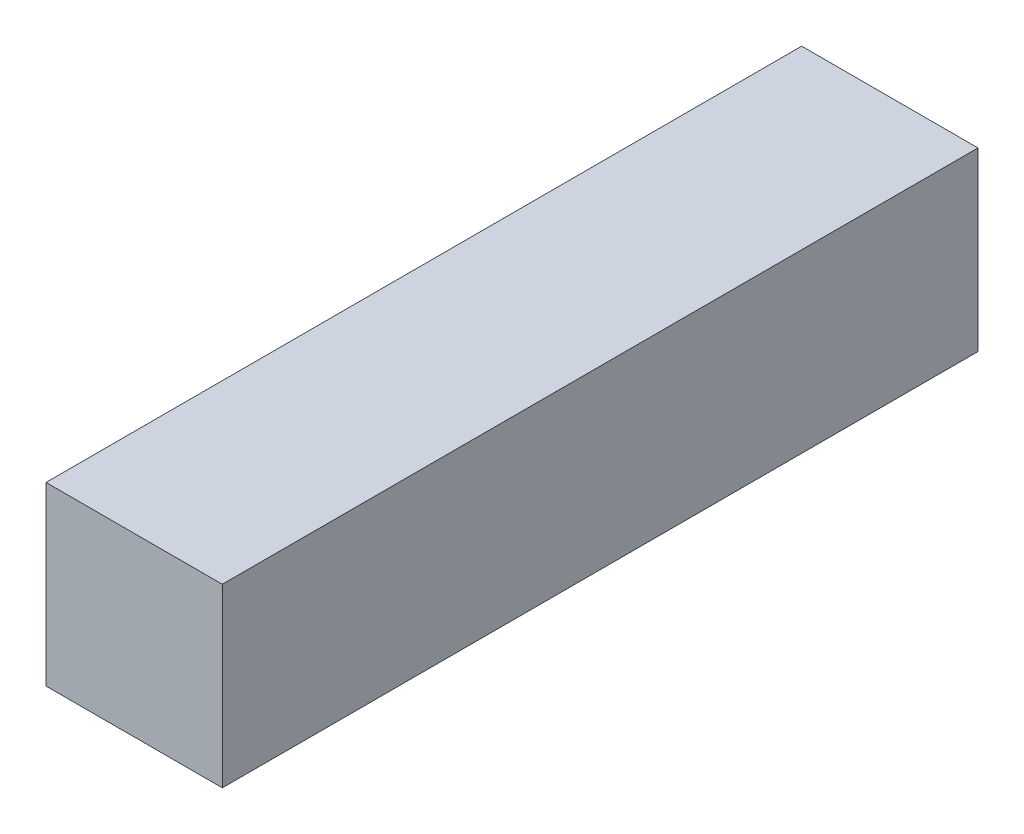
ISO-10303-21;
HEADER;
FILE_DESCRIPTION(('STEP AP214'),'2;1');
FILE_NAME('part.step','',(''),(''),'','','');
FILE_SCHEMA(('AUTOMOTIVE_DESIGN { 1 0 10303 214 1 1 1 1 }'));
ENDSEC;
DATA;
#1=APPLICATION_CONTEXT('core data for automotive mechanical design processes');
#2=APPLICATION_PROTOCOL_DEFINITION('international standard','automotive_design',2000,#1);
#3=PRODUCT_CONTEXT('',#1,'mechanical');
#4=PRODUCT('Part','Part','',(#3));
#5=PRODUCT_RELATED_PRODUCT_CATEGORY('part','',(#4));
#6=PRODUCT_DEFINITION_FORMATION('','',#4);
#7=PRODUCT_DEFINITION_CONTEXT('part definition',#1,'design');
#8=PRODUCT_DEFINITION('design','',#6,#7);
#9=PRODUCT_DEFINITION_SHAPE('','',#8);
#10=(LENGTH_UNIT() NAMED_UNIT(*) SI_UNIT(.MILLI.,.METRE.));
#11=(NAMED_UNIT(*) PLANE_ANGLE_UNIT() SI_UNIT($,.RADIAN.));
#12=(NAMED_UNIT(*) SI_UNIT($,.STERADIAN.) SOLID_ANGLE_UNIT());
#13=UNCERTAINTY_MEASURE_WITH_UNIT(LENGTH_MEASURE(1.E-05),#10,'distance_accuracy_value','');
#14=(GEOMETRIC_REPRESENTATION_CONTEXT(3) GLOBAL_UNCERTAINTY_ASSIGNED_CONTEXT((#13)) GLOBAL_UNIT_ASSIGNED_CONTEXT((#10,
#11,#12)) REPRESENTATION_CONTEXT('',''));
#15=CARTESIAN_POINT('',(0.,0.,0.));
#16=DIRECTION('',(0.,0.,1.));
#17=DIRECTION('',(1.,0.,0.));
#18=AXIS2_PLACEMENT_3D('',#15,#16,#17);
#19=CARTESIAN_POINT('',(-6.99999999998829,7.0000000000016,-30.));
#20=DIRECTION('',(-1.,0.,0.));
#21=DIRECTION('',(0.,0.,1.));
#22=AXIS2_PLACEMENT_3D('',#19,#20,#21);
#23=PLANE('',#22);
#24=DIRECTION('',(0.,-1.,0.));
#25=VECTOR('',#24,1.);
#26=CARTESIAN_POINT('',(-6.99999999998829,7.0000000000016,0.));
#27=LINE('',#26,#25);
#28=CARTESIAN_POINT('',(-6.99999999998829,7.0000000000016,0.));
#29=VERTEX_POINT('',#28);
#30=CARTESIAN_POINT('',(-6.99999999998829,0.,0.));
#31=VERTEX_POINT('',#30);
#32=EDGE_CURVE('E98',#29,#31,#27,.T.);
#33=ORIENTED_EDGE('',*,*,#32,.F.);
#34=DIRECTION('',(0.,0.,1.));
#35=VECTOR('',#34,1.);
#36=CARTESIAN_POINT('',(-6.99999999998829,7.0000000000016,-30.));
#37=LINE('',#36,#35);
#38=CARTESIAN_POINT('',(-6.99999999998829,7.0000000000016,-30.));
#39=VERTEX_POINT('',#38);
#40=EDGE_CURVE('E11',#39,#29,#37,.T.);
#41=ORIENTED_EDGE('',*,*,#40,.F.);
#42=DIRECTION('',(0.,-1.,0.));
#43=VECTOR('',#42,1.);
#44=CARTESIAN_POINT('',(-6.99999999998829,7.0000000000016,-30.));
#45=LINE('',#44,#43);
#46=CARTESIAN_POINT('',(-6.99999999998829,0.,-30.));
#47=VERTEX_POINT('',#46);
#48=EDGE_CURVE('E92',#39,#47,#45,.T.);
#49=ORIENTED_EDGE('',*,*,#48,.T.);
#50=DIRECTION('',(0.,0.,1.));
#51=VECTOR('',#50,1.);
#52=CARTESIAN_POINT('',(-6.99999999998829,0.,-30.));
#53=LINE('',#52,#51);
#54=EDGE_CURVE('E37',#47,#31,#53,.T.);
#55=ORIENTED_EDGE('',*,*,#54,.T.);
#56=EDGE_LOOP('',(#33,#41,#49,#55));
#57=FACE_BOUND('',#56,.T.);
#58=ADVANCED_FACE('F34',(#57),#23,.T.);
#59=CARTESIAN_POINT('',(-6.99999999998829,7.0000000000016,-30.));
#60=DIRECTION('',(0.,1.,0.));
#61=DIRECTION('',(0.,0.,1.));
#62=AXIS2_PLACEMENT_3D('',#59,#60,#61);
#63=PLANE('',#62);
#64=DIRECTION('',(-1.,0.,0.));
#65=VECTOR('',#64,1.);
#66=CARTESIAN_POINT('',(-6.99999999998829,7.0000000000016,0.));
#67=LINE('',#66,#65);
#68=CARTESIAN_POINT('',(0.,7.0000000000016,0.));
#69=VERTEX_POINT('',#68);
#70=EDGE_CURVE('E94',#69,#29,#67,.T.);
#71=ORIENTED_EDGE('',*,*,#70,.F.);
#72=DIRECTION('',(0.,0.,1.));
#73=VECTOR('',#72,1.);
#74=CARTESIAN_POINT('',(0.,7.0000000000016,-30.));
#75=LINE('',#74,#73);
#76=CARTESIAN_POINT('',(0.,7.0000000000016,-30.));
#77=VERTEX_POINT('',#76);
#78=EDGE_CURVE('E43',#77,#69,#75,.T.);
#79=ORIENTED_EDGE('',*,*,#78,.F.);
#80=DIRECTION('',(-1.,0.,0.));
#81=VECTOR('',#80,1.);
#82=CARTESIAN_POINT('',(-6.99999999998829,7.0000000000016,-30.));
#83=LINE('',#82,#81);
#84=EDGE_CURVE('E89',#77,#39,#83,.T.);
#85=ORIENTED_EDGE('',*,*,#84,.T.);
#86=ORIENTED_EDGE('',*,*,#40,.T.);
#87=EDGE_LOOP('',(#71,#79,#85,#86));
#88=FACE_BOUND('',#87,.T.);
#89=ADVANCED_FACE('F108',(#88),#63,.T.);
#90=CARTESIAN_POINT('',(0.,7.0000000000016,-30.));
#91=DIRECTION('',(1.,0.,0.));
#92=DIRECTION('',(0.,0.,-1.));
#93=AXIS2_PLACEMENT_3D('',#90,#91,#92);
#94=PLANE('',#93);
#95=DIRECTION('',(0.,1.,0.));
#96=VECTOR('',#95,1.);
#97=CARTESIAN_POINT('',(0.,7.0000000000016,0.));
#98=LINE('',#97,#96);
#99=CARTESIAN_POINT('',(0.,0.,0.));
#100=VERTEX_POINT('',#99);
#101=EDGE_CURVE('E84',#100,#69,#98,.T.);
#102=ORIENTED_EDGE('',*,*,#101,.F.);
#103=DIRECTION('',(0.,0.,1.));
#104=VECTOR('',#103,1.);
#105=CARTESIAN_POINT('',(0.,0.,-30.));
#106=LINE('',#105,#104);
#107=CARTESIAN_POINT('',(0.,0.,-30.));
#108=VERTEX_POINT('',#107);
#109=EDGE_CURVE('E79',#108,#100,#106,.T.);
#110=ORIENTED_EDGE('',*,*,#109,.F.);
#111=DIRECTION('',(0.,1.,0.));
#112=VECTOR('',#111,1.);
#113=CARTESIAN_POINT('',(0.,7.0000000000016,-30.));
#114=LINE('',#113,#112);
#115=EDGE_CURVE('E82',#108,#77,#114,.T.);
#116=ORIENTED_EDGE('',*,*,#115,.T.);
#117=ORIENTED_EDGE('',*,*,#78,.T.);
#118=EDGE_LOOP('',(#102,#110,#116,#117));
#119=FACE_BOUND('',#118,.T.);
#120=ADVANCED_FACE('F81',(#119),#94,.T.);
#121=CARTESIAN_POINT('',(-6.99999999998829,0.,-30.));
#122=DIRECTION('',(0.,-1.,0.));
#123=DIRECTION('',(0.,0.,-1.));
#124=AXIS2_PLACEMENT_3D('',#121,#122,#123);
#125=PLANE('',#124);
#126=DIRECTION('',(1.,0.,0.));
#127=VECTOR('',#126,1.);
#128=CARTESIAN_POINT('',(-6.99999999998829,0.,0.));
#129=LINE('',#128,#127);
#130=EDGE_CURVE('E101',#31,#100,#129,.T.);
#131=ORIENTED_EDGE('',*,*,#130,.F.);
#132=ORIENTED_EDGE('',*,*,#54,.F.);
#133=DIRECTION('',(1.,0.,0.));
#134=VECTOR('',#133,1.);
#135=CARTESIAN_POINT('',(-6.99999999998829,0.,-30.));
#136=LINE('',#135,#134);
#137=EDGE_CURVE('E88',#47,#108,#136,.T.);
#138=ORIENTED_EDGE('',*,*,#137,.T.);
#139=ORIENTED_EDGE('',*,*,#109,.T.);
#140=EDGE_LOOP('',(#131,#132,#138,#139));
#141=FACE_BOUND('',#140,.T.);
#142=ADVANCED_FACE('F91',(#141),#125,.T.);
#143=CARTESIAN_POINT('',(0.,0.,-30.));
#144=DIRECTION('',(0.,0.,1.));
#145=DIRECTION('',(1.,0.,0.));
#146=AXIS2_PLACEMENT_3D('',#143,#144,#145);
#147=PLANE('',#146);
#148=ORIENTED_EDGE('',*,*,#48,.F.);
#149=ORIENTED_EDGE('',*,*,#84,.F.);
#150=ORIENTED_EDGE('',*,*,#115,.F.);
#151=ORIENTED_EDGE('',*,*,#137,.F.);
#152=EDGE_LOOP('',(#148,#149,#150,#151));
#153=FACE_BOUND('',#152,.T.);
#154=ADVANCED_FACE('F87',(#153),#147,.F.);
#155=CARTESIAN_POINT('',(0.,0.,0.));
#156=DIRECTION('',(0.,0.,1.));
#157=DIRECTION('',(1.,0.,0.));
#158=AXIS2_PLACEMENT_3D('',#155,#156,#157);
#159=PLANE('',#158);
#160=ORIENTED_EDGE('',*,*,#32,.T.);
#161=ORIENTED_EDGE('',*,*,#130,.T.);
#162=ORIENTED_EDGE('',*,*,#101,.T.);
#163=ORIENTED_EDGE('',*,*,#70,.T.);
#164=EDGE_LOOP('',(#160,#161,#162,#163));
#165=FACE_BOUND('',#164,.T.);
#166=ADVANCED_FACE('F107',(#165),#159,.T.);
#167=CLOSED_SHELL('',(#58,#89,#120,#142,#154,#166));
#168=MANIFOLD_SOLID_BREP('B2',#167);
#169=ADVANCED_BREP_SHAPE_REPRESENTATION('',(#18,#168),#14);
#170=SHAPE_DEFINITION_REPRESENTATION(#9,#169);
ENDSEC;
END-ISO-10303-21;
